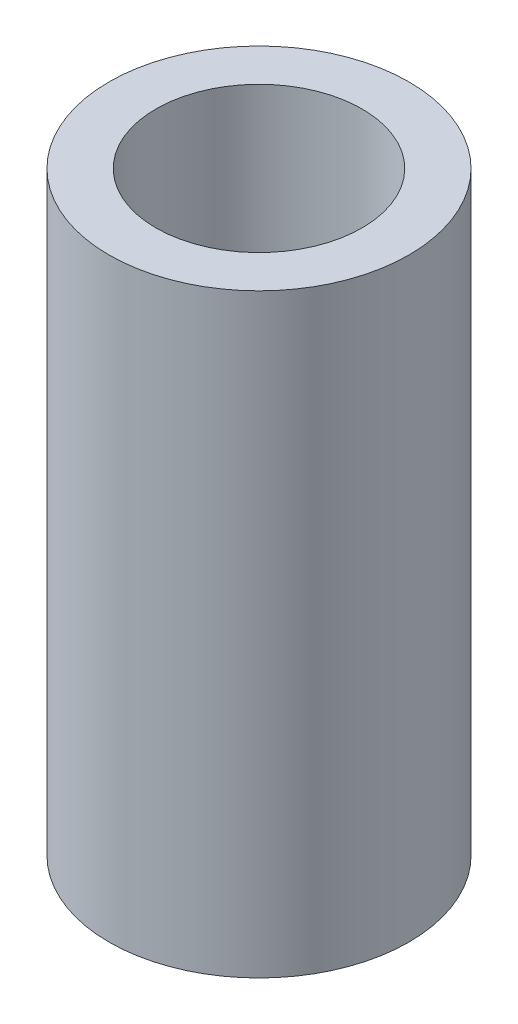
ISO-10303-21;
HEADER;
FILE_DESCRIPTION(('STEP AP214'),'2;1');
FILE_NAME('part.step','',(''),(''),'','','');
FILE_SCHEMA(('AUTOMOTIVE_DESIGN { 1 0 10303 214 1 1 1 1 }'));
ENDSEC;
DATA;
#1=APPLICATION_CONTEXT('core data for automotive mechanical design processes');
#2=APPLICATION_PROTOCOL_DEFINITION('international standard','automotive_design',2000,#1);
#3=PRODUCT_CONTEXT('',#1,'mechanical');
#4=PRODUCT('Part','Part','',(#3));
#5=PRODUCT_RELATED_PRODUCT_CATEGORY('part','',(#4));
#6=PRODUCT_DEFINITION_FORMATION('','',#4);
#7=PRODUCT_DEFINITION_CONTEXT('part definition',#1,'design');
#8=PRODUCT_DEFINITION('design','',#6,#7);
#9=PRODUCT_DEFINITION_SHAPE('','',#8);
#10=(LENGTH_UNIT() NAMED_UNIT(*) SI_UNIT(.MILLI.,.METRE.));
#11=(NAMED_UNIT(*) PLANE_ANGLE_UNIT() SI_UNIT($,.RADIAN.));
#12=(NAMED_UNIT(*) SI_UNIT($,.STERADIAN.) SOLID_ANGLE_UNIT());
#13=UNCERTAINTY_MEASURE_WITH_UNIT(LENGTH_MEASURE(1.E-05),#10,'distance_accuracy_value','');
#14=(GEOMETRIC_REPRESENTATION_CONTEXT(3) GLOBAL_UNCERTAINTY_ASSIGNED_CONTEXT((#13)) GLOBAL_UNIT_ASSIGNED_CONTEXT((#10,
#11,#12)) REPRESENTATION_CONTEXT('',''));
#15=CARTESIAN_POINT('',(0.,0.,0.));
#16=DIRECTION('',(0.,0.,1.));
#17=DIRECTION('',(1.,0.,0.));
#18=AXIS2_PLACEMENT_3D('',#15,#16,#17);
#19=CARTESIAN_POINT('',(0.,12.7,0.));
#20=DIRECTION('',(0.,1.,0.));
#21=DIRECTION('',(0.,0.,1.));
#22=AXIS2_PLACEMENT_3D('',#19,#20,#21);
#23=PLANE('',#22);
#24=CARTESIAN_POINT('',(0.,12.7,0.));
#25=DIRECTION('',(0.,1.,0.));
#26=DIRECTION('',(0.,0.,1.));
#27=AXIS2_PLACEMENT_3D('',#24,#25,#26);
#28=CIRCLE('',#27,3.2);
#29=CARTESIAN_POINT('',(0.,12.7,3.2));
#30=VERTEX_POINT('',#29);
#31=EDGE_CURVE('E10',#30,#30,#28,.T.);
#32=ORIENTED_EDGE('',*,*,#31,.T.);
#33=EDGE_LOOP('',(#32));
#34=FACE_BOUND('',#33,.T.);
#35=CARTESIAN_POINT('',(0.,12.7,0.));
#36=DIRECTION('',(0.,1.,0.));
#37=DIRECTION('',(0.,0.,1.));
#38=AXIS2_PLACEMENT_3D('',#35,#36,#37);
#39=CIRCLE('',#38,2.2);
#40=CARTESIAN_POINT('',(0.,12.7,2.2));
#41=VERTEX_POINT('',#40);
#42=EDGE_CURVE('E54',#41,#41,#39,.T.);
#43=ORIENTED_EDGE('',*,*,#42,.F.);
#44=EDGE_LOOP('',(#43));
#45=FACE_BOUND('',#44,.T.);
#46=ADVANCED_FACE('F41',(#34,#45),#23,.T.);
#47=CARTESIAN_POINT('',(0.,0.,0.));
#48=DIRECTION('',(0.,1.,0.));
#49=DIRECTION('',(0.,0.,1.));
#50=AXIS2_PLACEMENT_3D('',#47,#48,#49);
#51=PLANE('',#50);
#52=CARTESIAN_POINT('',(0.,0.,0.));
#53=DIRECTION('',(0.,1.,0.));
#54=DIRECTION('',(0.,0.,1.));
#55=AXIS2_PLACEMENT_3D('',#52,#53,#54);
#56=CIRCLE('',#55,3.2);
#57=CARTESIAN_POINT('',(0.,0.,3.2));
#58=VERTEX_POINT('',#57);
#59=EDGE_CURVE('E45',#58,#58,#56,.T.);
#60=ORIENTED_EDGE('',*,*,#59,.F.);
#61=EDGE_LOOP('',(#60));
#62=FACE_BOUND('',#61,.T.);
#63=CARTESIAN_POINT('',(0.,0.,0.));
#64=DIRECTION('',(0.,1.,0.));
#65=DIRECTION('',(0.,0.,1.));
#66=AXIS2_PLACEMENT_3D('',#63,#64,#65);
#67=CIRCLE('',#66,2.2);
#68=CARTESIAN_POINT('',(0.,0.,2.2));
#69=VERTEX_POINT('',#68);
#70=EDGE_CURVE('E56',#69,#69,#67,.T.);
#71=ORIENTED_EDGE('',*,*,#70,.T.);
#72=EDGE_LOOP('',(#71));
#73=FACE_BOUND('',#72,.T.);
#74=ADVANCED_FACE('F68',(#62,#73),#51,.F.);
#75=CARTESIAN_POINT('',(0.,12.7,0.));
#76=DIRECTION('',(0.,-1.,0.));
#77=DIRECTION('',(0.,0.,-1.));
#78=AXIS2_PLACEMENT_3D('',#75,#76,#77);
#79=CYLINDRICAL_SURFACE('',#78,3.2);
#80=ORIENTED_EDGE('',*,*,#31,.F.);
#81=EDGE_LOOP('',(#80));
#82=FACE_BOUND('',#81,.T.);
#83=ORIENTED_EDGE('',*,*,#59,.T.);
#84=EDGE_LOOP('',(#83));
#85=FACE_BOUND('',#84,.T.);
#86=ADVANCED_FACE('F43',(#82,#85),#79,.T.);
#87=CARTESIAN_POINT('',(0.,12.7,0.));
#88=DIRECTION('',(0.,-1.,0.));
#89=DIRECTION('',(0.,0.,-1.));
#90=AXIS2_PLACEMENT_3D('',#87,#88,#89);
#91=CYLINDRICAL_SURFACE('',#90,2.2);
#92=ORIENTED_EDGE('',*,*,#42,.T.);
#93=EDGE_LOOP('',(#92));
#94=FACE_BOUND('',#93,.T.);
#95=ORIENTED_EDGE('',*,*,#70,.F.);
#96=EDGE_LOOP('',(#95));
#97=FACE_BOUND('',#96,.T.);
#98=ADVANCED_FACE('F64',(#94,#97),#91,.F.);
#99=CLOSED_SHELL('',(#46,#74,#86,#98));
#100=MANIFOLD_SOLID_BREP('B2',#99);
#101=ADVANCED_BREP_SHAPE_REPRESENTATION('',(#18,#100),#14);
#102=SHAPE_DEFINITION_REPRESENTATION(#9,#101);
ENDSEC;
END-ISO-10303-21;
